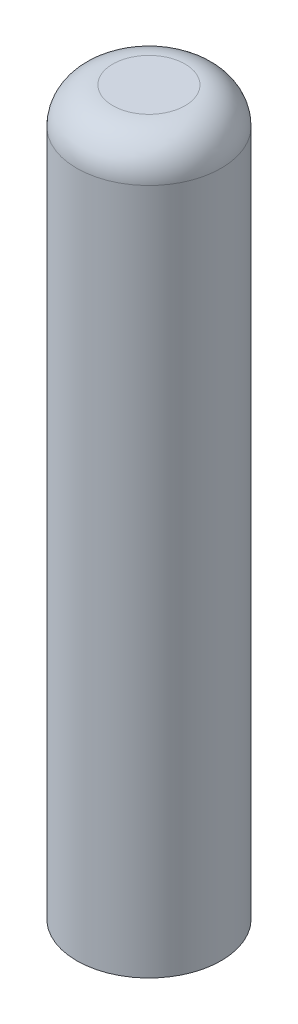
ISO-10303-21;
HEADER;
FILE_DESCRIPTION(('STEP AP214'),'2;1');
FILE_NAME('part.step','',(''),(''),'','','');
FILE_SCHEMA(('AUTOMOTIVE_DESIGN { 1 0 10303 214 1 1 1 1 }'));
ENDSEC;
DATA;
#1=APPLICATION_CONTEXT('core data for automotive mechanical design processes');
#2=APPLICATION_PROTOCOL_DEFINITION('international standard','automotive_design',2000,#1);
#3=PRODUCT_CONTEXT('',#1,'mechanical');
#4=PRODUCT('Part','Part','',(#3));
#5=PRODUCT_RELATED_PRODUCT_CATEGORY('part','',(#4));
#6=PRODUCT_DEFINITION_FORMATION('','',#4);
#7=PRODUCT_DEFINITION_CONTEXT('part definition',#1,'design');
#8=PRODUCT_DEFINITION('design','',#6,#7);
#9=PRODUCT_DEFINITION_SHAPE('','',#8);
#10=(LENGTH_UNIT() NAMED_UNIT(*) SI_UNIT(.MILLI.,.METRE.));
#11=(NAMED_UNIT(*) PLANE_ANGLE_UNIT() SI_UNIT($,.RADIAN.));
#12=(NAMED_UNIT(*) SI_UNIT($,.STERADIAN.) SOLID_ANGLE_UNIT());
#13=UNCERTAINTY_MEASURE_WITH_UNIT(LENGTH_MEASURE(1.E-05),#10,'distance_accuracy_value','');
#14=(GEOMETRIC_REPRESENTATION_CONTEXT(3) GLOBAL_UNCERTAINTY_ASSIGNED_CONTEXT((#13)) GLOBAL_UNIT_ASSIGNED_CONTEXT((#10,
#11,#12)) REPRESENTATION_CONTEXT('',''));
#15=CARTESIAN_POINT('',(0.,0.,0.));
#16=DIRECTION('',(0.,0.,1.));
#17=DIRECTION('',(1.,0.,0.));
#18=AXIS2_PLACEMENT_3D('',#15,#16,#17);
#19=CARTESIAN_POINT('',(0.,50.8,0.));
#20=DIRECTION('',(0.,-1.,0.));
#21=DIRECTION('',(0.,0.,-1.));
#22=AXIS2_PLACEMENT_3D('',#19,#20,#21);
#23=CYLINDRICAL_SURFACE('',#22,5.08);
#24=CARTESIAN_POINT('',(0.,48.26,0.));
#25=DIRECTION('',(0.,1.,0.));
#26=DIRECTION('',(0.,0.,1.));
#27=AXIS2_PLACEMENT_3D('',#24,#25,#26);
#28=CIRCLE('',#27,5.08);
#29=CARTESIAN_POINT('',(0.,48.26,5.08));
#30=VERTEX_POINT('',#29);
#31=EDGE_CURVE('E10',#30,#30,#28,.F.);
#32=ORIENTED_EDGE('',*,*,#31,.T.);
#33=EDGE_LOOP('',(#32));
#34=FACE_BOUND('',#33,.T.);
#35=CARTESIAN_POINT('',(0.,0.,0.));
#36=DIRECTION('',(0.,1.,0.));
#37=DIRECTION('',(0.,0.,1.));
#38=AXIS2_PLACEMENT_3D('',#35,#36,#37);
#39=CIRCLE('',#38,5.08);
#40=CARTESIAN_POINT('',(0.,0.,5.08));
#41=VERTEX_POINT('',#40);
#42=EDGE_CURVE('E48',#41,#41,#39,.T.);
#43=ORIENTED_EDGE('',*,*,#42,.T.);
#44=EDGE_LOOP('',(#43));
#45=FACE_BOUND('',#44,.T.);
#46=ADVANCED_FACE('F37',(#34,#45),#23,.T.);
#47=CARTESIAN_POINT('',(0.,50.8,0.));
#48=DIRECTION('',(0.,1.,0.));
#49=DIRECTION('',(0.,0.,1.));
#50=AXIS2_PLACEMENT_3D('',#47,#48,#49);
#51=PLANE('',#50);
#52=CARTESIAN_POINT('',(0.,50.8,0.));
#53=DIRECTION('',(0.,1.,0.));
#54=DIRECTION('',(0.,0.,1.));
#55=AXIS2_PLACEMENT_3D('',#52,#53,#54);
#56=CIRCLE('',#55,2.54);
#57=CARTESIAN_POINT('',(0.,50.8,2.54));
#58=VERTEX_POINT('',#57);
#59=EDGE_CURVE('E44',#58,#58,#56,.T.);
#60=ORIENTED_EDGE('',*,*,#59,.T.);
#61=EDGE_LOOP('',(#60));
#62=FACE_BOUND('',#61,.T.);
#63=ADVANCED_FACE('F58',(#62),#51,.T.);
#64=CARTESIAN_POINT('',(0.,0.,0.));
#65=DIRECTION('',(0.,1.,0.));
#66=DIRECTION('',(0.,0.,1.));
#67=AXIS2_PLACEMENT_3D('',#64,#65,#66);
#68=PLANE('',#67);
#69=ORIENTED_EDGE('',*,*,#42,.F.);
#70=EDGE_LOOP('',(#69));
#71=FACE_BOUND('',#70,.T.);
#72=ADVANCED_FACE('F56',(#71),#68,.F.);
#73=CARTESIAN_POINT('',(0.,48.26,0.));
#74=DIRECTION('',(0.,1.,0.));
#75=DIRECTION('',(0.,0.,1.));
#76=AXIS2_PLACEMENT_3D('',#73,#74,#75);
#77=TOROIDAL_SURFACE('',#76,2.54,2.54);
#78=ORIENTED_EDGE('',*,*,#31,.F.);
#79=EDGE_LOOP('',(#78));
#80=FACE_BOUND('',#79,.T.);
#81=ORIENTED_EDGE('',*,*,#59,.F.);
#82=EDGE_LOOP('',(#81));
#83=FACE_BOUND('',#82,.T.);
#84=ADVANCED_FACE('F39',(#80,#83),#77,.T.);
#85=CLOSED_SHELL('',(#46,#63,#72,#84));
#86=MANIFOLD_SOLID_BREP('B2',#85);
#87=ADVANCED_BREP_SHAPE_REPRESENTATION('',(#18,#86),#14);
#88=SHAPE_DEFINITION_REPRESENTATION(#9,#87);
ENDSEC;
END-ISO-10303-21;
